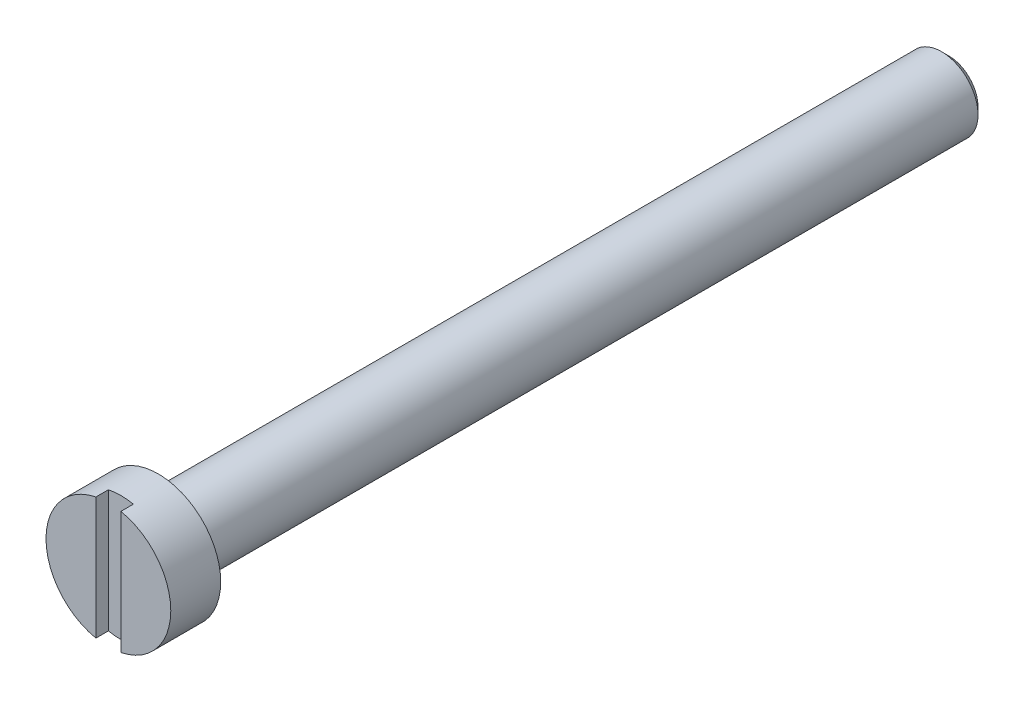
ISO-10303-21;
HEADER;
FILE_DESCRIPTION(('STEP AP214'),'2;1');
FILE_NAME('part.step','',(''),(''),'','','');
FILE_SCHEMA(('AUTOMOTIVE_DESIGN { 1 0 10303 214 1 1 1 1 }'));
ENDSEC;
DATA;
#1=APPLICATION_CONTEXT('core data for automotive mechanical design processes');
#2=APPLICATION_PROTOCOL_DEFINITION('international standard','automotive_design',2000,#1);
#3=PRODUCT_CONTEXT('',#1,'mechanical');
#4=PRODUCT('Part','Part','',(#3));
#5=PRODUCT_RELATED_PRODUCT_CATEGORY('part','',(#4));
#6=PRODUCT_DEFINITION_FORMATION('','',#4);
#7=PRODUCT_DEFINITION_CONTEXT('part definition',#1,'design');
#8=PRODUCT_DEFINITION('design','',#6,#7);
#9=PRODUCT_DEFINITION_SHAPE('','',#8);
#10=(LENGTH_UNIT() NAMED_UNIT(*) SI_UNIT(.MILLI.,.METRE.));
#11=(NAMED_UNIT(*) PLANE_ANGLE_UNIT() SI_UNIT($,.RADIAN.));
#12=(NAMED_UNIT(*) SI_UNIT($,.STERADIAN.) SOLID_ANGLE_UNIT());
#13=UNCERTAINTY_MEASURE_WITH_UNIT(LENGTH_MEASURE(1.E-05),#10,'distance_accuracy_value','');
#14=(GEOMETRIC_REPRESENTATION_CONTEXT(3) GLOBAL_UNCERTAINTY_ASSIGNED_CONTEXT((#13)) GLOBAL_UNIT_ASSIGNED_CONTEXT((#10,
#11,#12)) REPRESENTATION_CONTEXT('',''));
#15=CARTESIAN_POINT('',(0.,0.,0.));
#16=DIRECTION('',(0.,0.,1.));
#17=DIRECTION('',(1.,0.,0.));
#18=AXIS2_PLACEMENT_3D('',#15,#16,#17);
#19=CARTESIAN_POINT('',(0.,0.,2.4));
#20=DIRECTION('',(0.,0.,-1.));
#21=DIRECTION('',(-1.,0.,0.));
#22=AXIS2_PLACEMENT_3D('',#19,#20,#21);
#23=CYLINDRICAL_SURFACE('',#22,3.);
#24=CARTESIAN_POINT('',(0.,0.,0.));
#25=DIRECTION('',(0.,0.,1.));
#26=DIRECTION('',(1.,0.,0.));
#27=AXIS2_PLACEMENT_3D('',#24,#25,#26);
#28=CIRCLE('',#27,3.);
#29=CARTESIAN_POINT('',(3.,0.,0.));
#30=VERTEX_POINT('',#29);
#31=EDGE_CURVE('E102',#30,#30,#28,.T.);
#32=ORIENTED_EDGE('',*,*,#31,.T.);
#33=EDGE_LOOP('',(#32));
#34=FACE_BOUND('',#33,.T.);
#35=DIRECTION('',(0.,0.,-1.));
#36=VECTOR('',#35,1.);
#37=CARTESIAN_POINT('',(0.600000000000028,-2.93938769133982,2.4));
#38=LINE('',#37,#36);
#39=CARTESIAN_POINT('',(0.600000000000028,-2.93938769133982,1.8));
#40=VERTEX_POINT('',#39);
#41=CARTESIAN_POINT('',(0.600000000000028,-2.93938769133982,2.4));
#42=VERTEX_POINT('',#41);
#43=EDGE_CURVE('E61',#40,#42,#38,.F.);
#44=ORIENTED_EDGE('',*,*,#43,.F.);
#45=CARTESIAN_POINT('',(0.,0.,1.8));
#46=DIRECTION('',(0.,0.,1.));
#47=DIRECTION('',(1.,0.,0.));
#48=AXIS2_PLACEMENT_3D('',#45,#46,#47);
#49=CIRCLE('',#48,3.);
#50=CARTESIAN_POINT('',(-0.599999999999972,-2.93938769133982,1.8));
#51=VERTEX_POINT('',#50);
#52=EDGE_CURVE('E11',#51,#40,#49,.T.);
#53=ORIENTED_EDGE('',*,*,#52,.F.);
#54=DIRECTION('',(0.,0.,-1.));
#55=VECTOR('',#54,1.);
#56=CARTESIAN_POINT('',(-0.599999999999972,-2.93938769133982,2.4));
#57=LINE('',#56,#55);
#58=CARTESIAN_POINT('',(-0.599999999999972,-2.93938769133982,2.4));
#59=VERTEX_POINT('',#58);
#60=EDGE_CURVE('E90',#59,#51,#57,.T.);
#61=ORIENTED_EDGE('',*,*,#60,.F.);
#62=CARTESIAN_POINT('',(0.,0.,2.4));
#63=DIRECTION('',(0.,0.,1.));
#64=DIRECTION('',(1.,0.,0.));
#65=AXIS2_PLACEMENT_3D('',#62,#63,#64);
#66=CIRCLE('',#65,3.);
#67=CARTESIAN_POINT('',(-0.599999999999972,2.93938769133981,2.4));
#68=VERTEX_POINT('',#67);
#69=EDGE_CURVE('E94',#68,#59,#66,.T.);
#70=ORIENTED_EDGE('',*,*,#69,.F.);
#71=DIRECTION('',(0.,0.,-1.));
#72=VECTOR('',#71,1.);
#73=CARTESIAN_POINT('',(-0.599999999999972,2.93938769133981,2.4));
#74=LINE('',#73,#72);
#75=CARTESIAN_POINT('',(-0.599999999999972,2.93938769133981,1.8));
#76=VERTEX_POINT('',#75);
#77=EDGE_CURVE('E53',#76,#68,#74,.F.);
#78=ORIENTED_EDGE('',*,*,#77,.F.);
#79=CARTESIAN_POINT('',(0.600000000000028,2.93938769133981,1.8));
#80=VERTEX_POINT('',#79);
#81=EDGE_CURVE('E42',#80,#76,#49,.T.);
#82=ORIENTED_EDGE('',*,*,#81,.F.);
#83=DIRECTION('',(0.,0.,-1.));
#84=VECTOR('',#83,1.);
#85=CARTESIAN_POINT('',(0.600000000000028,2.93938769133981,2.4));
#86=LINE('',#85,#84);
#87=CARTESIAN_POINT('',(0.600000000000028,2.93938769133981,2.4));
#88=VERTEX_POINT('',#87);
#89=EDGE_CURVE('E100',#88,#80,#86,.T.);
#90=ORIENTED_EDGE('',*,*,#89,.F.);
#91=EDGE_CURVE('E103',#42,#88,#66,.T.);
#92=ORIENTED_EDGE('',*,*,#91,.F.);
#93=EDGE_LOOP('',(#44,#53,#61,#70,#78,#82,#90,#92));
#94=FACE_BOUND('',#93,.T.);
#95=ADVANCED_FACE('F38',(#34,#94),#23,.T.);
#96=CARTESIAN_POINT('',(0.,0.,2.4));
#97=DIRECTION('',(0.,0.,1.));
#98=DIRECTION('',(1.,0.,0.));
#99=AXIS2_PLACEMENT_3D('',#96,#97,#98);
#100=PLANE('',#99);
#101=ORIENTED_EDGE('',*,*,#91,.T.);
#102=DIRECTION('',(0.,-1.,0.));
#103=VECTOR('',#102,1.);
#104=CARTESIAN_POINT('',(0.600000000000028,0.,2.4));
#105=LINE('',#104,#103);
#106=EDGE_CURVE('E87',#88,#42,#105,.T.);
#107=ORIENTED_EDGE('',*,*,#106,.T.);
#108=EDGE_LOOP('',(#101,#107));
#109=FACE_BOUND('',#108,.T.);
#110=ADVANCED_FACE('F120',(#109),#100,.T.);
#111=ORIENTED_EDGE('',*,*,#69,.T.);
#112=DIRECTION('',(0.,1.,0.));
#113=VECTOR('',#112,1.);
#114=CARTESIAN_POINT('',(-0.599999999999972,0.,2.4));
#115=LINE('',#114,#113);
#116=EDGE_CURVE('E117',#59,#68,#115,.T.);
#117=ORIENTED_EDGE('',*,*,#116,.T.);
#118=EDGE_LOOP('',(#111,#117));
#119=FACE_BOUND('',#118,.T.);
#120=ADVANCED_FACE('F136',(#119),#100,.T.);
#121=CARTESIAN_POINT('',(0.,0.,0.));
#122=DIRECTION('',(0.,0.,1.));
#123=DIRECTION('',(1.,0.,0.));
#124=AXIS2_PLACEMENT_3D('',#121,#122,#123);
#125=PLANE('',#124);
#126=ORIENTED_EDGE('',*,*,#31,.F.);
#127=EDGE_LOOP('',(#126));
#128=FACE_BOUND('',#127,.T.);
#129=CARTESIAN_POINT('',(0.,0.,0.));
#130=DIRECTION('',(0.,0.,1.));
#131=DIRECTION('',(1.,0.,0.));
#132=AXIS2_PLACEMENT_3D('',#129,#130,#131);
#133=CIRCLE('',#132,1.75);
#134=CARTESIAN_POINT('',(1.75,0.,0.));
#135=VERTEX_POINT('',#134);
#136=EDGE_CURVE('E108',#135,#135,#133,.F.);
#137=ORIENTED_EDGE('',*,*,#136,.F.);
#138=EDGE_LOOP('',(#137));
#139=FACE_BOUND('',#138,.T.);
#140=ADVANCED_FACE('F139',(#128,#139),#125,.F.);
#141=CARTESIAN_POINT('',(0.,0.,-38.));
#142=DIRECTION('',(0.,0.,1.));
#143=DIRECTION('',(1.,0.,0.));
#144=AXIS2_PLACEMENT_3D('',#141,#142,#143);
#145=CYLINDRICAL_SURFACE('',#144,1.75);
#146=CARTESIAN_POINT('',(0.,0.,-37.6645));
#147=DIRECTION('',(0.,0.,-1.));
#148=DIRECTION('',(-1.,0.,0.));
#149=AXIS2_PLACEMENT_3D('',#146,#147,#148);
#150=CIRCLE('',#149,1.75);
#151=CARTESIAN_POINT('',(-1.75,0.,-37.6645));
#152=VERTEX_POINT('',#151);
#153=EDGE_CURVE('E114',#152,#152,#150,.F.);
#154=ORIENTED_EDGE('',*,*,#153,.T.);
#155=EDGE_LOOP('',(#154));
#156=FACE_BOUND('',#155,.T.);
#157=ORIENTED_EDGE('',*,*,#136,.T.);
#158=EDGE_LOOP('',(#157));
#159=FACE_BOUND('',#158,.T.);
#160=ADVANCED_FACE('F141',(#156,#159),#145,.T.);
#161=CARTESIAN_POINT('',(0.,0.,-38.));
#162=DIRECTION('',(0.,0.,-1.));
#163=DIRECTION('',(-1.,0.,0.));
#164=AXIS2_PLACEMENT_3D('',#161,#162,#163);
#165=PLANE('',#164);
#166=CARTESIAN_POINT('',(0.,0.,-38.));
#167=DIRECTION('',(0.,0.,-1.));
#168=DIRECTION('',(-1.,0.,0.));
#169=AXIS2_PLACEMENT_3D('',#166,#167,#168);
#170=CIRCLE('',#169,1.4145);
#171=CARTESIAN_POINT('',(-1.4145,0.,-38.));
#172=VERTEX_POINT('',#171);
#173=EDGE_CURVE('E111',#172,#172,#170,.T.);
#174=ORIENTED_EDGE('',*,*,#173,.T.);
#175=EDGE_LOOP('',(#174));
#176=FACE_BOUND('',#175,.T.);
#177=ADVANCED_FACE('F145',(#176),#165,.T.);
#178=CARTESIAN_POINT('',(0.,0.,-38.));
#179=DIRECTION('',(0.,0.,1.));
#180=DIRECTION('',(1.,0.,0.));
#181=AXIS2_PLACEMENT_3D('',#178,#179,#180);
#182=CONICAL_SURFACE('',#181,1.4145,0.785398163397446);
#183=ORIENTED_EDGE('',*,*,#153,.F.);
#184=EDGE_LOOP('',(#183));
#185=FACE_BOUND('',#184,.T.);
#186=ORIENTED_EDGE('',*,*,#173,.F.);
#187=EDGE_LOOP('',(#186));
#188=FACE_BOUND('',#187,.T.);
#189=ADVANCED_FACE('F40',(#185,#188),#182,.T.);
#190=CARTESIAN_POINT('',(-0.599999999999972,38.,1.80000000000001));
#191=DIRECTION('',(0.,0.,1.));
#192=DIRECTION('',(1.,0.,0.));
#193=AXIS2_PLACEMENT_3D('',#190,#191,#192);
#194=PLANE('',#193);
#195=ORIENTED_EDGE('',*,*,#81,.T.);
#196=DIRECTION('',(0.,-1.,0.));
#197=VECTOR('',#196,1.);
#198=CARTESIAN_POINT('',(-0.599999999999972,38.,1.80000000000001));
#199=LINE('',#198,#197);
#200=EDGE_CURVE('E82',#76,#51,#199,.T.);
#201=ORIENTED_EDGE('',*,*,#200,.T.);
#202=ORIENTED_EDGE('',*,*,#52,.T.);
#203=DIRECTION('',(0.,-1.,0.));
#204=VECTOR('',#203,1.);
#205=CARTESIAN_POINT('',(0.600000000000028,38.,1.80000000000001));
#206=LINE('',#205,#204);
#207=EDGE_CURVE('E84',#80,#40,#206,.T.);
#208=ORIENTED_EDGE('',*,*,#207,.F.);
#209=EDGE_LOOP('',(#195,#201,#202,#208));
#210=FACE_BOUND('',#209,.T.);
#211=ADVANCED_FACE('F81',(#210),#194,.T.);
#212=CARTESIAN_POINT('',(0.600000000000028,38.,1.80000000000001));
#213=DIRECTION('',(-1.,0.,0.));
#214=DIRECTION('',(0.,0.,1.));
#215=AXIS2_PLACEMENT_3D('',#212,#213,#214);
#216=PLANE('',#215);
#217=ORIENTED_EDGE('',*,*,#89,.T.);
#218=ORIENTED_EDGE('',*,*,#207,.T.);
#219=ORIENTED_EDGE('',*,*,#43,.T.);
#220=ORIENTED_EDGE('',*,*,#106,.F.);
#221=EDGE_LOOP('',(#217,#218,#219,#220));
#222=FACE_BOUND('',#221,.T.);
#223=ADVANCED_FACE('F121',(#222),#216,.T.);
#224=CARTESIAN_POINT('',(-0.599999999999972,38.,1.80000000000001));
#225=DIRECTION('',(1.,0.,0.));
#226=DIRECTION('',(0.,0.,-1.));
#227=AXIS2_PLACEMENT_3D('',#224,#225,#226);
#228=PLANE('',#227);
#229=ORIENTED_EDGE('',*,*,#60,.T.);
#230=ORIENTED_EDGE('',*,*,#200,.F.);
#231=ORIENTED_EDGE('',*,*,#77,.T.);
#232=ORIENTED_EDGE('',*,*,#116,.F.);
#233=EDGE_LOOP('',(#229,#230,#231,#232));
#234=FACE_BOUND('',#233,.T.);
#235=ADVANCED_FACE('F88',(#234),#228,.T.);
#236=CLOSED_SHELL('',(#95,#110,#120,#140,#160,#177,#189,#211,#223,#235));
#237=MANIFOLD_SOLID_BREP('B2',#236);
#238=ADVANCED_BREP_SHAPE_REPRESENTATION('',(#18,#237),#14);
#239=SHAPE_DEFINITION_REPRESENTATION(#9,#238);
ENDSEC;
END-ISO-10303-21;
